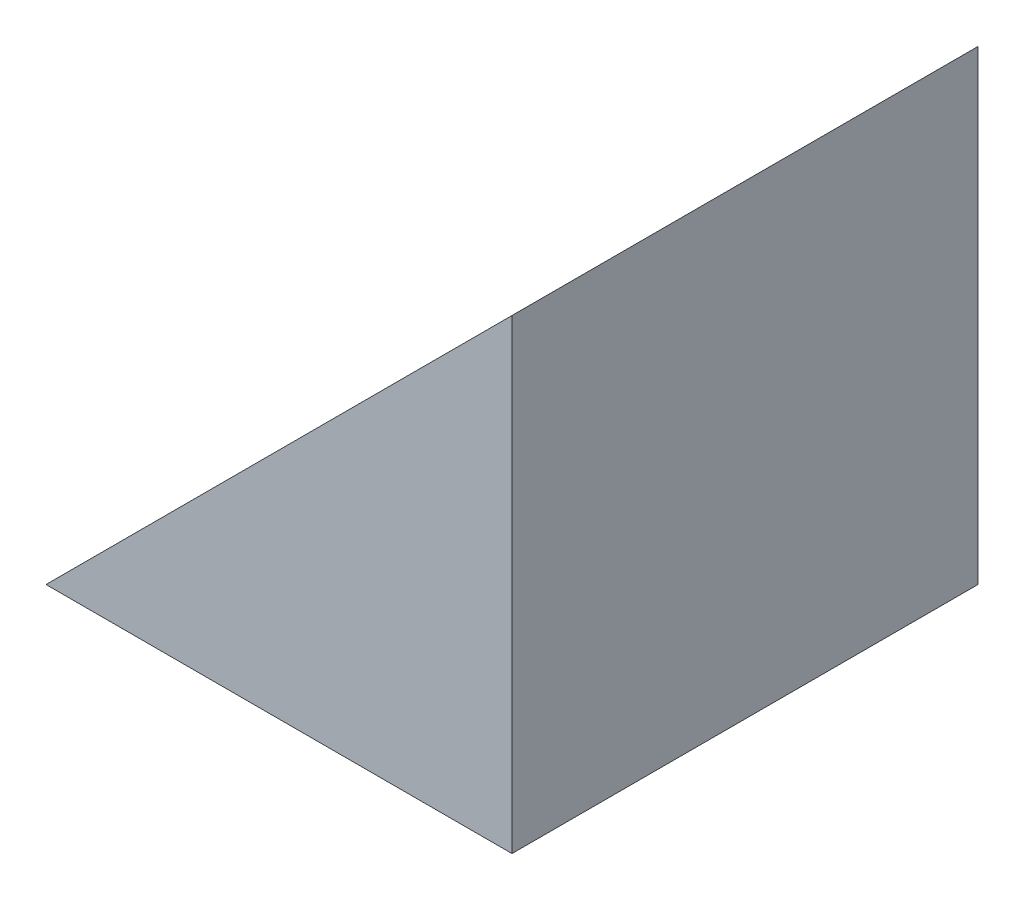
ISO-10303-21;
HEADER;
FILE_DESCRIPTION(('STEP AP214'),'2;1');
FILE_NAME('part.step','',(''),(''),'','','');
FILE_SCHEMA(('AUTOMOTIVE_DESIGN { 1 0 10303 214 1 1 1 1 }'));
ENDSEC;
DATA;
#1=APPLICATION_CONTEXT('core data for automotive mechanical design processes');
#2=APPLICATION_PROTOCOL_DEFINITION('international standard','automotive_design',2000,#1);
#3=PRODUCT_CONTEXT('',#1,'mechanical');
#4=PRODUCT('Part','Part','',(#3));
#5=PRODUCT_RELATED_PRODUCT_CATEGORY('part','',(#4));
#6=PRODUCT_DEFINITION_FORMATION('','',#4);
#7=PRODUCT_DEFINITION_CONTEXT('part definition',#1,'design');
#8=PRODUCT_DEFINITION('design','',#6,#7);
#9=PRODUCT_DEFINITION_SHAPE('','',#8);
#10=(LENGTH_UNIT() NAMED_UNIT(*) SI_UNIT(.MILLI.,.METRE.));
#11=(NAMED_UNIT(*) PLANE_ANGLE_UNIT() SI_UNIT($,.RADIAN.));
#12=(NAMED_UNIT(*) SI_UNIT($,.STERADIAN.) SOLID_ANGLE_UNIT());
#13=UNCERTAINTY_MEASURE_WITH_UNIT(LENGTH_MEASURE(1.E-05),#10,'distance_accuracy_value','');
#14=(GEOMETRIC_REPRESENTATION_CONTEXT(3) GLOBAL_UNCERTAINTY_ASSIGNED_CONTEXT((#13)) GLOBAL_UNIT_ASSIGNED_CONTEXT((#10,
#11,#12)) REPRESENTATION_CONTEXT('',''));
#15=CARTESIAN_POINT('',(0.,0.,0.));
#16=DIRECTION('',(0.,0.,1.));
#17=DIRECTION('',(1.,0.,0.));
#18=AXIS2_PLACEMENT_3D('',#15,#16,#17);
#19=CARTESIAN_POINT('',(22.0139720275741,16.7301628502786,6.3));
#20=DIRECTION('',(0.,1.,0.));
#21=DIRECTION('',(0.,0.,1.));
#22=AXIS2_PLACEMENT_3D('',#19,#20,#21);
#23=PLANE('',#22);
#24=DIRECTION('',(1.,0.,0.));
#25=VECTOR('',#24,1.);
#26=CARTESIAN_POINT('',(22.0139720275741,16.7301628502786,0.));
#27=LINE('',#26,#25);
#28=CARTESIAN_POINT('',(15.7139720275741,16.7301628502786,0.));
#29=VERTEX_POINT('',#28);
#30=CARTESIAN_POINT('',(22.0139720275741,16.7301628502786,0.));
#31=VERTEX_POINT('',#30);
#32=EDGE_CURVE('E82',#29,#31,#27,.T.);
#33=ORIENTED_EDGE('',*,*,#32,.T.);
#34=DIRECTION('',(0.,0.,-1.));
#35=VECTOR('',#34,1.);
#36=CARTESIAN_POINT('',(22.0139720275741,16.7301628502786,6.3));
#37=LINE('',#36,#35);
#38=CARTESIAN_POINT('',(22.0139720275741,16.7301628502786,6.3));
#39=VERTEX_POINT('',#38);
#40=EDGE_CURVE('E11',#39,#31,#37,.T.);
#41=ORIENTED_EDGE('',*,*,#40,.F.);
#42=DIRECTION('',(1.,0.,0.));
#43=VECTOR('',#42,1.);
#44=CARTESIAN_POINT('',(22.0139720275741,16.7301628502786,6.3));
#45=LINE('',#44,#43);
#46=CARTESIAN_POINT('',(15.7139720275741,16.7301628502786,6.3));
#47=VERTEX_POINT('',#46);
#48=EDGE_CURVE('E75',#47,#39,#45,.T.);
#49=ORIENTED_EDGE('',*,*,#48,.F.);
#50=DIRECTION('',(0.,0.,-1.));
#51=VECTOR('',#50,1.);
#52=CARTESIAN_POINT('',(15.7139720275741,16.7301628502786,6.3));
#53=LINE('',#52,#51);
#54=EDGE_CURVE('E83',#47,#29,#53,.T.);
#55=ORIENTED_EDGE('',*,*,#54,.T.);
#56=EDGE_LOOP('',(#33,#41,#49,#55));
#57=FACE_BOUND('',#56,.T.);
#58=ADVANCED_FACE('F35',(#57),#23,.F.);
#59=CARTESIAN_POINT('',(22.0139720275741,16.7301628502786,6.3));
#60=DIRECTION('',(-1.,0.,0.));
#61=DIRECTION('',(0.,0.,1.));
#62=AXIS2_PLACEMENT_3D('',#59,#60,#61);
#63=PLANE('',#62);
#64=DIRECTION('',(0.,1.,0.));
#65=VECTOR('',#64,1.);
#66=CARTESIAN_POINT('',(22.0139720275741,16.7301628502786,0.));
#67=LINE('',#66,#65);
#68=CARTESIAN_POINT('',(22.0139720275741,23.0301628502786,0.));
#69=VERTEX_POINT('',#68);
#70=EDGE_CURVE('E63',#31,#69,#67,.T.);
#71=ORIENTED_EDGE('',*,*,#70,.T.);
#72=DIRECTION('',(0.,0.,-1.));
#73=VECTOR('',#72,1.);
#74=CARTESIAN_POINT('',(22.0139720275741,23.0301628502786,6.3));
#75=LINE('',#74,#73);
#76=CARTESIAN_POINT('',(22.0139720275741,23.0301628502786,6.3));
#77=VERTEX_POINT('',#76);
#78=EDGE_CURVE('E43',#77,#69,#75,.T.);
#79=ORIENTED_EDGE('',*,*,#78,.F.);
#80=DIRECTION('',(0.,1.,0.));
#81=VECTOR('',#80,1.);
#82=CARTESIAN_POINT('',(22.0139720275741,16.7301628502786,6.3));
#83=LINE('',#82,#81);
#84=EDGE_CURVE('E71',#39,#77,#83,.T.);
#85=ORIENTED_EDGE('',*,*,#84,.F.);
#86=ORIENTED_EDGE('',*,*,#40,.T.);
#87=EDGE_LOOP('',(#71,#79,#85,#86));
#88=FACE_BOUND('',#87,.T.);
#89=ADVANCED_FACE('F72',(#88),#63,.F.);
#90=CARTESIAN_POINT('',(15.7139720275741,16.7301628502786,6.3));
#91=DIRECTION('',(0.707106781186547,-0.707106781186548,0.));
#92=DIRECTION('',(0.707106781186548,0.707106781186547,0.));
#93=AXIS2_PLACEMENT_3D('',#90,#91,#92);
#94=PLANE('',#93);
#95=DIRECTION('',(-0.707106781186548,-0.707106781186547,0.));
#96=VECTOR('',#95,1.);
#97=CARTESIAN_POINT('',(15.7139720275741,16.7301628502786,0.));
#98=LINE('',#97,#96);
#99=EDGE_CURVE('E68',#69,#29,#98,.T.);
#100=ORIENTED_EDGE('',*,*,#99,.T.);
#101=ORIENTED_EDGE('',*,*,#54,.F.);
#102=DIRECTION('',(-0.707106781186548,-0.707106781186547,0.));
#103=VECTOR('',#102,1.);
#104=CARTESIAN_POINT('',(15.7139720275741,16.7301628502786,6.3));
#105=LINE('',#104,#103);
#106=EDGE_CURVE('E51',#77,#47,#105,.T.);
#107=ORIENTED_EDGE('',*,*,#106,.F.);
#108=ORIENTED_EDGE('',*,*,#78,.T.);
#109=EDGE_LOOP('',(#100,#101,#107,#108));
#110=FACE_BOUND('',#109,.T.);
#111=ADVANCED_FACE('F90',(#110),#94,.F.);
#112=CARTESIAN_POINT('',(0.,0.,6.3));
#113=DIRECTION('',(0.,0.,-1.));
#114=DIRECTION('',(-1.,0.,0.));
#115=AXIS2_PLACEMENT_3D('',#112,#113,#114);
#116=PLANE('',#115);
#117=ORIENTED_EDGE('',*,*,#48,.T.);
#118=ORIENTED_EDGE('',*,*,#84,.T.);
#119=ORIENTED_EDGE('',*,*,#106,.T.);
#120=EDGE_LOOP('',(#117,#118,#119));
#121=FACE_BOUND('',#120,.T.);
#122=ADVANCED_FACE('F78',(#121),#116,.F.);
#123=CARTESIAN_POINT('',(0.,0.,0.));
#124=DIRECTION('',(0.,0.,-1.));
#125=DIRECTION('',(-1.,0.,0.));
#126=AXIS2_PLACEMENT_3D('',#123,#124,#125);
#127=PLANE('',#126);
#128=ORIENTED_EDGE('',*,*,#32,.F.);
#129=ORIENTED_EDGE('',*,*,#99,.F.);
#130=ORIENTED_EDGE('',*,*,#70,.F.);
#131=EDGE_LOOP('',(#128,#129,#130));
#132=FACE_BOUND('',#131,.T.);
#133=ADVANCED_FACE('F91',(#132),#127,.T.);
#134=CLOSED_SHELL('',(#58,#89,#111,#122,#133));
#135=MANIFOLD_SOLID_BREP('B2',#134);
#136=ADVANCED_BREP_SHAPE_REPRESENTATION('',(#18,#135),#14);
#137=SHAPE_DEFINITION_REPRESENTATION(#9,#136);
ENDSEC;
END-ISO-10303-21;
